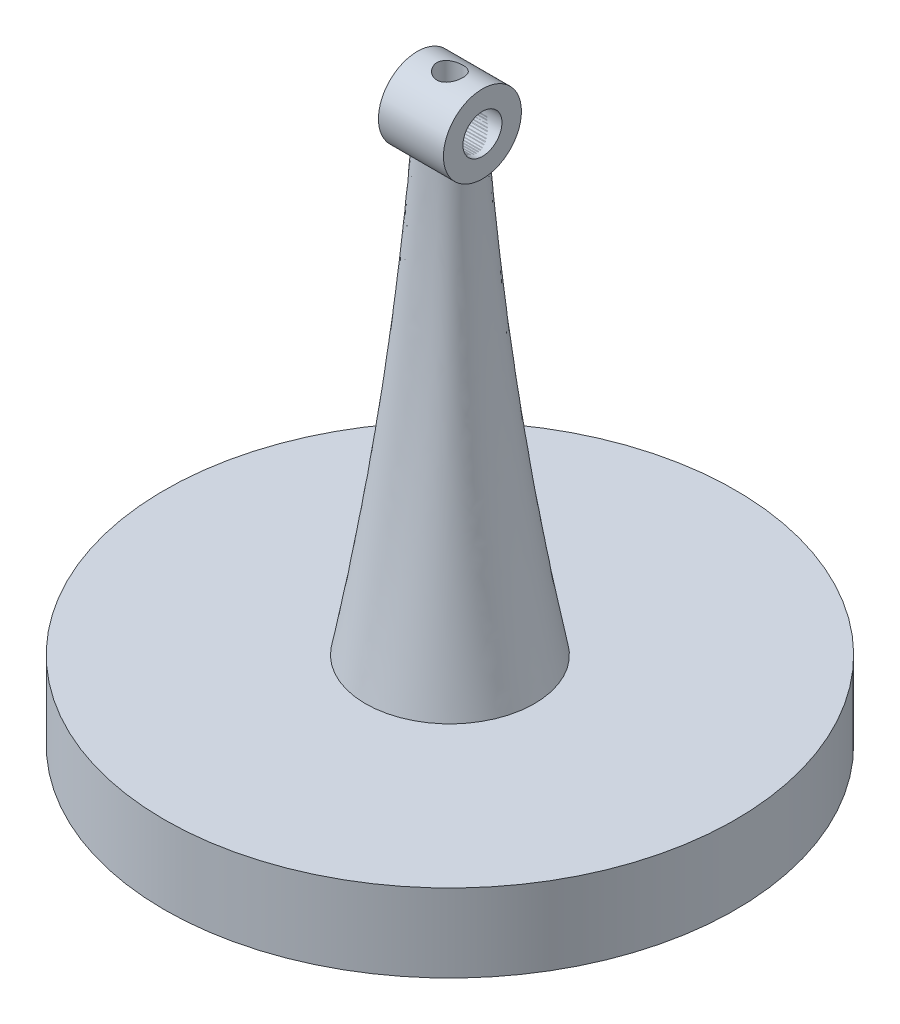
ISO-10303-21;
HEADER;
FILE_DESCRIPTION(('STEP AP214'),'2;1');
FILE_NAME('part.step','',(''),(''),'','','');
FILE_SCHEMA(('AUTOMOTIVE_DESIGN { 1 0 10303 214 1 1 1 1 }'));
ENDSEC;
DATA;
#1=APPLICATION_CONTEXT('core data for automotive mechanical design processes');
#2=APPLICATION_PROTOCOL_DEFINITION('international standard','automotive_design',2000,#1);
#3=PRODUCT_CONTEXT('',#1,'mechanical');
#4=PRODUCT('Part','Part','',(#3));
#5=PRODUCT_RELATED_PRODUCT_CATEGORY('part','',(#4));
#6=PRODUCT_DEFINITION_FORMATION('','',#4);
#7=PRODUCT_DEFINITION_CONTEXT('part definition',#1,'design');
#8=PRODUCT_DEFINITION('design','',#6,#7);
#9=PRODUCT_DEFINITION_SHAPE('','',#8);
#10=(LENGTH_UNIT() NAMED_UNIT(*) SI_UNIT(.MILLI.,.METRE.));
#11=(NAMED_UNIT(*) PLANE_ANGLE_UNIT() SI_UNIT($,.RADIAN.));
#12=(NAMED_UNIT(*) SI_UNIT($,.STERADIAN.) SOLID_ANGLE_UNIT());
#13=UNCERTAINTY_MEASURE_WITH_UNIT(LENGTH_MEASURE(1.E-05),#10,'distance_accuracy_value','');
#14=(GEOMETRIC_REPRESENTATION_CONTEXT(3) GLOBAL_UNCERTAINTY_ASSIGNED_CONTEXT((#13)) GLOBAL_UNIT_ASSIGNED_CONTEXT((#10,
#11,#12)) REPRESENTATION_CONTEXT('',''));
#15=CARTESIAN_POINT('',(0.,0.,0.));
#16=DIRECTION('',(0.,0.,1.));
#17=DIRECTION('',(1.,0.,0.));
#18=AXIS2_PLACEMENT_3D('',#15,#16,#17);
#19=CARTESIAN_POINT('',(-1.25,20.98,0.));
#20=DIRECTION('',(1.,0.,0.));
#21=DIRECTION('',(0.,0.,-1.));
#22=AXIS2_PLACEMENT_3D('',#19,#20,#21);
#23=CYLINDRICAL_SURFACE('',#22,1.5);
#24=CARTESIAN_POINT('',(-1.25,20.98,0.));
#25=DIRECTION('',(1.,0.,0.));
#26=DIRECTION('',(0.,0.,-1.));
#27=AXIS2_PLACEMENT_3D('',#24,#25,#26);
#28=CIRCLE('',#27,1.5);
#29=CARTESIAN_POINT('',(-1.25,20.98,-1.5));
#30=VERTEX_POINT('',#29);
#31=EDGE_CURVE('E13',#30,#30,#28,.T.);
#32=ORIENTED_EDGE('',*,*,#31,.T.);
#33=EDGE_LOOP('',(#32));
#34=FACE_BOUND('',#33,.T.);
#35=CARTESIAN_POINT('',(1.25,20.98,0.));
#36=DIRECTION('',(1.,0.,0.));
#37=DIRECTION('',(0.,0.,-1.));
#38=AXIS2_PLACEMENT_3D('',#35,#36,#37);
#39=CIRCLE('',#38,1.5);
#40=CARTESIAN_POINT('',(1.25,20.98,-1.5));
#41=VERTEX_POINT('',#40);
#42=EDGE_CURVE('E166',#41,#41,#39,.T.);
#43=ORIENTED_EDGE('',*,*,#42,.F.);
#44=EDGE_LOOP('',(#43));
#45=FACE_BOUND('',#44,.T.);
#46=CARTESIAN_POINT('',(0.5,22.48,0.));
#47=CARTESIAN_POINT('',(0.50000012686582,22.4800000765047,0.0272816814433617));
#48=CARTESIAN_POINT('',(0.497759866936391,22.4792488475377,0.0545625972692751));
#49=CARTESIAN_POINT('',(0.488885445591391,22.4763260510164,0.108320880436486));
#50=CARTESIAN_POINT('',(0.482250828025542,22.4741543360107,0.134798164059408));
#51=CARTESIAN_POINT('',(0.464840378307973,22.4686265395323,0.186166394750889));
#52=CARTESIAN_POINT('',(0.454071468770353,22.4652724386545,0.211059912943019));
#53=CARTESIAN_POINT('',(0.428729413580838,22.4577222285864,0.258687468402661));
#54=CARTESIAN_POINT('',(0.414155517498742,22.4535259533379,0.281421078479346));
#55=CARTESIAN_POINT('',(0.38108709757058,22.4445704722161,0.324870837511139));
#56=CARTESIAN_POINT('',(0.362484382869586,22.4397977823228,0.345501850149179));
#57=CARTESIAN_POINT('',(0.322116422646884,22.4303015739117,0.383416346351018));
#58=CARTESIAN_POINT('',(0.300350482536368,22.4255780664382,0.400699092744639));
#59=CARTESIAN_POINT('',(0.253507442401128,22.4165666624014,0.431912471114024));
#60=CARTESIAN_POINT('',(0.22835313013151,22.4122951964352,0.445732429110873));
#61=CARTESIAN_POINT('',(0.175911952773154,22.4048765270363,0.468909436938504));
#62=CARTESIAN_POINT('',(0.148625741427696,22.4017289805919,0.478267848692048));
#63=CARTESIAN_POINT('',(0.0936633892497512,22.3970565165522,0.491936730754162));
#64=CARTESIAN_POINT('',(0.0660313957373302,22.3954804796009,0.496406724138347));
#65=CARTESIAN_POINT('',(0.0103681229003003,22.3939782838957,0.500670561669923));
#66=CARTESIAN_POINT('',(-0.0176630303637377,22.39405161531,0.500465850802425));
#67=CARTESIAN_POINT('',(-0.071968315220251,22.3957950748538,0.495509951851011));
#68=CARTESIAN_POINT('',(-0.0982642014590378,22.3973920792875,0.49096695658331));
#69=CARTESIAN_POINT('',(-0.149696709803889,22.4018832886729,0.477803081424896));
#70=CARTESIAN_POINT('',(-0.174833192717663,22.4047776489341,0.469181713295986));
#71=CARTESIAN_POINT('',(-0.22370637479561,22.4115895556425,0.447969529030054));
#72=CARTESIAN_POINT('',(-0.247414012734729,22.4155228289619,0.435317024353617));
#73=CARTESIAN_POINT('',(-0.292435454139899,22.4239627928823,0.406444553151583));
#74=CARTESIAN_POINT('',(-0.313748563466701,22.4284696489533,0.390223556182006));
#75=CARTESIAN_POINT('',(-0.354545799080377,22.4378366458376,0.353674666341114));
#76=CARTESIAN_POINT('',(-0.373876347254532,22.4427029467739,0.333176575038154));
#77=CARTESIAN_POINT('',(-0.408865633331702,22.4520346919355,0.289169784985033));
#78=CARTESIAN_POINT('',(-0.424524019082249,22.4565000976904,0.265660797830407));
#79=CARTESIAN_POINT('',(-0.451848150117534,22.4645855396889,0.215973806523133));
#80=CARTESIAN_POINT('',(-0.463472745670366,22.4681967500402,0.189771638208168));
#81=CARTESIAN_POINT('',(-0.482101586977856,22.4741028357222,0.135634541682253));
#82=CARTESIAN_POINT('',(-0.489107437711719,22.4763981682744,0.107700219077476));
#83=CARTESIAN_POINT('',(-0.498027833011179,22.4793381353572,0.0521919147646513));
#84=CARTESIAN_POINT('',(-0.500149904586375,22.4800500091687,0.0246547999324221));
#85=CARTESIAN_POINT('',(-0.499833663200767,22.4799445134741,-0.0303875349801187));
#86=CARTESIAN_POINT('',(-0.497396120010066,22.4791274020968,-0.0578927596598238));
#87=CARTESIAN_POINT('',(-0.488194046132017,22.4761001235856,-0.11125993315213));
#88=CARTESIAN_POINT('',(-0.481556896975238,22.4739309935561,-0.137146403417428));
#89=CARTESIAN_POINT('',(-0.46430327776665,22.4684592341502,-0.187427979289781));
#90=CARTESIAN_POINT('',(-0.453686300266162,22.4651564602327,-0.21182289425428));
#91=CARTESIAN_POINT('',(-0.42846478407955,22.4576446564371,-0.259144148196661));
#92=CARTESIAN_POINT('',(-0.4137627033582,22.4534140737815,-0.282014979608665));
#93=CARTESIAN_POINT('',(-0.380902924993473,22.4445262695787,-0.325032415067702));
#94=CARTESIAN_POINT('',(-0.362744171984919,22.4398689179594,-0.345178183897447));
#95=CARTESIAN_POINT('',(-0.322510624495867,22.4303842399124,-0.383126253903507));
#96=CARTESIAN_POINT('',(-0.300295386533375,22.4255588054758,-0.400780484624246));
#97=CARTESIAN_POINT('',(-0.253114216097749,22.4164998664349,-0.432128761160427));
#98=CARTESIAN_POINT('',(-0.228148260694898,22.4122663667656,-0.445822773960422));
#99=CARTESIAN_POINT('',(-0.176163492346702,22.4049119591015,-0.46879846521168));
#100=CARTESIAN_POINT('',(-0.14914896037861,22.4017888045032,-0.478089066098883));
#101=CARTESIAN_POINT('',(-0.0938106749379246,22.3970541619957,-0.491947333396081));
#102=CARTESIAN_POINT('',(-0.065487517283468,22.3954419931135,-0.496517127480622));
#103=CARTESIAN_POINT('',(-0.00990145199339416,22.3939892943754,-0.50063814123519));
#104=CARTESIAN_POINT('',(0.0173411701258687,22.3940620017215,-0.500435128655463));
#105=CARTESIAN_POINT('',(0.0713825374498718,22.3957563496178,-0.495621146727439));
#106=CARTESIAN_POINT('',(0.0981813089764556,22.3973778979794,-0.491010439729443));
#107=CARTESIAN_POINT('',(0.150067831506334,22.4019226213947,-0.47768590656349));
#108=CARTESIAN_POINT('',(0.175178412503616,22.4048204900776,-0.46905167300744));
#109=CARTESIAN_POINT('',(0.223613703467766,22.4115819941272,-0.447989682880191));
#110=CARTESIAN_POINT('',(0.24693801559363,22.4154458438265,-0.435561084276989));
#111=CARTESIAN_POINT('',(0.292241834961846,22.4239141461203,-0.406630346291624));
#112=CARTESIAN_POINT('',(0.314118250949298,22.428543558208,-0.389974121382266));
#113=CARTESIAN_POINT('',(0.354844906691996,22.4379167814189,-0.353321441567848));
#114=CARTESIAN_POINT('',(0.373694287844009,22.4426606245626,-0.333324042225747));
#115=CARTESIAN_POINT('',(0.408572206144619,22.451950152627,-0.289620778460337));
#116=CARTESIAN_POINT('',(0.424462173875508,22.4564809090061,-0.265800756749862));
#117=CARTESIAN_POINT('',(0.451995214425316,22.4646299558633,-0.215678678703314));
#118=CARTESIAN_POINT('',(0.463639372961019,22.4682484795397,-0.189377259066175));
#119=CARTESIAN_POINT('',(0.481860816244338,22.4740275753427,-0.136246823600487));
#120=CARTESIAN_POINT('',(0.488641233131689,22.4762460621126,-0.109493878838204));
#121=CARTESIAN_POINT('',(0.497710140338563,22.4792320353211,-0.0551602080051238));
#122=CARTESIAN_POINT('',(0.499999871748268,22.4799999226595,-0.0275797127843734));
#123=CARTESIAN_POINT('',(0.5,22.48,0.));
#124=B_SPLINE_CURVE_WITH_KNOTS('',3,(#46,#47,#48,#49,#50,#51,#52,#53,#54,#55,#56,#57,#58,#59,
#60,#61,#62,#63,#64,#65,#66,#67,#68,#69,#70,#71,#72,#73,#74,#75,#76,#77,#78,#79,#80,#81,#82,#83,
#84,#85,#86,#87,#88,#89,#90,#91,#92,#93,#94,#95,#96,#97,#98,#99,#100,#101,#102,#103,#104,#105,
#106,#107,#108,#109,#110,#111,#112,#113,#114,#115,#116,#117,#118,#119,#120,#121,#122,#123),
.UNSPECIFIED.,.T.,.F.,(4,2,2,2,2,2,2,2,2,2,2,2,2,2,2,2,2,2,2,2,2,2,2,2,2,2,2,2,2,2,2,2,2,2,2,2,
2,2,4),(0.,0.0817435530130054,0.16349559263376,0.245111336435137,0.32674318889955,
0.41092342141378,0.495122166437651,0.581741924117352,0.668335223464167,0.752009628687921,
0.835658169894179,0.915484132713153,0.995319654234162,1.07644085573241,1.15758551274779,
1.24296652901359,1.32835572978984,1.41459202820854,1.50079834434279,1.5832679158326,
1.66572356577763,1.74579078984782,1.82586822637727,1.90805199917543,1.99026090406621,
2.07620511436051,2.16215004113174,2.24792006907883,2.33365142346098,2.41497833023984,
2.49630039666268,2.57607793530789,2.65587319078569,2.73915033336483,2.8224510555247,
2.9089983040813,2.99552340566808,3.07818279177487,3.1608193300965),.UNSPECIFIED.);
#125=CARTESIAN_POINT('',(0.5,22.48,0.));
#126=VERTEX_POINT('',#125);
#127=EDGE_CURVE('E174',#126,#126,#124,.T.);
#128=ORIENTED_EDGE('',*,*,#127,.T.);
#129=EDGE_LOOP('',(#128));
#130=FACE_BOUND('',#129,.T.);
#131=ADVANCED_FACE('F149',(#34,#45,#130),#23,.T.);
#132=CARTESIAN_POINT('',(-1.25,20.98,0.));
#133=DIRECTION('',(1.,0.,0.));
#134=DIRECTION('',(0.,0.,-1.));
#135=AXIS2_PLACEMENT_3D('',#132,#133,#134);
#136=CYLINDRICAL_SURFACE('',#135,0.750000000000001);
#137=CARTESIAN_POINT('',(-1.25,20.98,0.));
#138=DIRECTION('',(1.,0.,0.));
#139=DIRECTION('',(0.,0.,-1.));
#140=AXIS2_PLACEMENT_3D('',#137,#138,#139);
#141=CIRCLE('',#140,0.750000000000001);
#142=CARTESIAN_POINT('',(-1.25,20.98,-0.750000000000001));
#143=VERTEX_POINT('',#142);
#144=EDGE_CURVE('E162',#143,#143,#141,.T.);
#145=ORIENTED_EDGE('',*,*,#144,.F.);
#146=EDGE_LOOP('',(#145));
#147=FACE_BOUND('',#146,.T.);
#148=CARTESIAN_POINT('',(1.25,20.98,0.));
#149=DIRECTION('',(1.,0.,0.));
#150=DIRECTION('',(0.,0.,-1.));
#151=AXIS2_PLACEMENT_3D('',#148,#149,#150);
#152=CIRCLE('',#151,0.750000000000001);
#153=CARTESIAN_POINT('',(1.25,20.98,-0.750000000000001));
#154=VERTEX_POINT('',#153);
#155=EDGE_CURVE('E171',#154,#154,#152,.T.);
#156=ORIENTED_EDGE('',*,*,#155,.T.);
#157=EDGE_LOOP('',(#156));
#158=FACE_BOUND('',#157,.T.);
#159=CARTESIAN_POINT('',(0.,21.5390169943749,-0.5));
#160=CARTESIAN_POINT('',(0.0244070776840954,21.5390193832135,-0.49999863498352));
#161=CARTESIAN_POINT('',(0.048822688418298,21.5406451774997,-0.498197481256266));
#162=CARTESIAN_POINT('',(0.0967799779214887,21.5468299313731,-0.491145670797246));
#163=CARTESIAN_POINT('',(0.120320008884651,21.5513941520635,-0.485888826470456));
#164=CARTESIAN_POINT('',(0.165683860466932,21.5626414645324,-0.472339654190862));
#165=CARTESIAN_POINT('',(0.187521924183623,21.569303904478,-0.464076795035392));
#166=CARTESIAN_POINT('',(0.229466458087109,21.583960236713,-0.444835020984149));
#167=CARTESIAN_POINT('',(0.249572567494098,21.5919544053994,-0.433855542030581));
#168=CARTESIAN_POINT('',(0.290911721903807,21.6098651823272,-0.407506025019366));
#169=CARTESIAN_POINT('',(0.311833029429035,21.6198873402251,-0.391718588629478));
#170=CARTESIAN_POINT('',(0.351000677218425,21.6398620682709,-0.357048049351916));
#171=CARTESIAN_POINT('',(0.36924438041445,21.6498145607451,-0.33816193294292));
#172=CARTESIAN_POINT('',(0.40516091469522,21.670222046309,-0.294539226235978));
#173=CARTESIAN_POINT('',(0.422370627943749,21.6805419646171,-0.269351609914803));
#174=CARTESIAN_POINT('',(0.45216052387239,21.6988962112069,-0.215617741053339));
#175=CARTESIAN_POINT('',(0.464745878507682,21.7069330905775,-0.187075288080716));
#176=CARTESIAN_POINT('',(0.483389100254282,21.7189997686617,-0.130812268370296));
#177=CARTESIAN_POINT('',(0.490020836123828,21.7233779390396,-0.103358681295646));
#178=CARTESIAN_POINT('',(0.498546122320886,21.7290243636548,-0.0474238621827458));
#179=CARTESIAN_POINT('',(0.500445639806351,21.7302965344059,-0.0189439703217284));
#180=CARTESIAN_POINT('',(0.499456887512755,21.7296384043074,0.0335367625578244));
#181=CARTESIAN_POINT('',(0.497252737170764,21.7281656622753,0.0575601595019357));
#182=CARTESIAN_POINT('',(0.489477237160325,21.7230204569751,0.104809658317514));
#183=CARTESIAN_POINT('',(0.483905641924176,21.7193478332828,0.128035701912199));
#184=CARTESIAN_POINT('',(0.469701078801438,21.7101302292594,0.17301948441757));
#185=CARTESIAN_POINT('',(0.461080278700454,21.7045926949568,0.194782655961269));
#186=CARTESIAN_POINT('',(0.44111158926191,21.6920527611908,0.236552287663175));
#187=CARTESIAN_POINT('',(0.429763202124747,21.685050094363,0.256558426242141));
#188=CARTESIAN_POINT('',(0.403005315635176,21.6690451461268,0.297071072990657));
#189=CARTESIAN_POINT('',(0.387258119161966,21.6599010219802,0.31729787024907));
#190=CARTESIAN_POINT('',(0.35302533013011,21.6410015045676,0.354997018745571));
#191=CARTESIAN_POINT('',(0.334535513516751,21.6312451820382,0.372465033798458));
#192=CARTESIAN_POINT('',(0.292009197446911,21.6103751123605,0.406930588315245));
#193=CARTESIAN_POINT('',(0.267557230071629,21.5992858000224,0.423433982815731));
#194=CARTESIAN_POINT('',(0.215622540195098,21.5786890270778,0.452087187363571));
#195=CARTESIAN_POINT('',(0.188145001396809,21.5691789288373,0.464244296637116));
#196=CARTESIAN_POINT('',(0.138820234482036,21.5556571757673,0.480831811419357));
#197=CARTESIAN_POINT('',(0.117601657486106,21.5508509114443,0.486476979368779));
#198=CARTESIAN_POINT('',(0.0742401275460673,21.543522599474,0.49494888894997));
#199=CARTESIAN_POINT('',(0.0520988472070614,21.5409965919556,0.497780517410882));
#200=CARTESIAN_POINT('',(0.00738925338998441,21.5386188924687,0.500448500372263));
#201=CARTESIAN_POINT('',(-0.0151804946294691,21.5387788346673,0.500271824383034));
#202=CARTESIAN_POINT('',(-0.0599209584887981,21.5417747009213,0.496904074290662));
#203=CARTESIAN_POINT('',(-0.0820913360276867,21.544612794118,0.493710556724944));
#204=CARTESIAN_POINT('',(-0.1243473543862,21.5523199437557,0.484749527968672));
#205=CARTESIAN_POINT('',(-0.14448192724666,21.5570829676885,0.479115436328642));
#206=CARTESIAN_POINT('',(-0.183531559016105,21.5680748963198,0.46555760406773));
#207=CARTESIAN_POINT('',(-0.202446205754526,21.5743042931836,0.457633094499908));
#208=CARTESIAN_POINT('',(-0.242550500943963,21.5890287090536,0.437908366515755));
#209=CARTESIAN_POINT('',(-0.263439202815248,21.597727703844,0.425650072113155));
#210=CARTESIAN_POINT('',(-0.303104200582259,21.6156562872823,0.398381828822968));
#211=CARTESIAN_POINT('',(-0.321877879164484,21.6248865124464,0.383368529729879));
#212=CARTESIAN_POINT('',(-0.360990586892403,21.6451891957079,0.347191644256549));
#213=CARTESIAN_POINT('',(-0.380775712068715,21.6562236303212,0.325400966279174));
#214=CARTESIAN_POINT('',(-0.416454170728047,21.6769389546291,0.278274872172408));
#215=CARTESIAN_POINT('',(-0.432350942812357,21.6866210369796,0.252942619366139));
#216=CARTESIAN_POINT('',(-0.456972934730588,21.7019770531006,0.204371868704485));
#217=CARTESIAN_POINT('',(-0.466489126110322,21.7080636452761,0.181665591221554));
#218=CARTESIAN_POINT('',(-0.482151798579666,21.7181967696688,0.134689269755798));
#219=CARTESIAN_POINT('',(-0.488301125714782,21.7222450246802,0.110420565965121));
#220=CARTESIAN_POINT('',(-0.496924240959738,21.7279459100665,0.0608423480760647));
#221=CARTESIAN_POINT('',(-0.499381669876642,21.7295878771414,0.0355287092313005));
#222=CARTESIAN_POINT('',(-0.500411962854291,21.7302745525726,-0.0152138866448036));
#223=CARTESIAN_POINT('',(-0.498985187989176,21.7293195023466,-0.0406428327378411));
#224=CARTESIAN_POINT('',(-0.492585127748773,21.7250738899439,-0.0889393831319761));
#225=CARTESIAN_POINT('',(-0.487877253784226,21.7219581930269,-0.11185878576814));
#226=CARTESIAN_POINT('',(-0.475440497642743,21.7138402655152,-0.156504605748237));
#227=CARTESIAN_POINT('',(-0.467711146164711,21.7088377418597,-0.178230837168601));
#228=CARTESIAN_POINT('',(-0.449015323777597,21.6969794137241,-0.221286824154885));
#229=CARTESIAN_POINT('',(-0.437887423120557,21.6900331223988,-0.242520897311469));
#230=CARTESIAN_POINT('',(-0.41296233884947,21.6749385205558,-0.282888165658915));
#231=CARTESIAN_POINT('',(-0.399163558033892,21.6667894914901,-0.302020092968711));
#232=CARTESIAN_POINT('',(-0.366842774389124,21.6484823288226,-0.340823555555943));
#233=CARTESIAN_POINT('',(-0.347919243976968,21.6382097852622,-0.360106699021094));
#234=CARTESIAN_POINT('',(-0.307221614512106,21.6176333946743,-0.395400055909323));
#235=CARTESIAN_POINT('',(-0.285445402771145,21.60732953003,-0.411407820861153));
#236=CARTESIAN_POINT('',(-0.241033102331492,21.5884605338798,-0.438783133747656));
#237=CARTESIAN_POINT('',(-0.218589547501261,21.579822716954,-0.450411617234018));
#238=CARTESIAN_POINT('',(-0.171678887763389,21.5643687538787,-0.470289505859439));
#239=CARTESIAN_POINT('',(-0.147215826600274,21.5575490777471,-0.47854547569061));
#240=CARTESIAN_POINT('',(-0.102307132863304,21.5479776302106,-0.489840656181975));
#241=CARTESIAN_POINT('',(-0.0821729406695298,21.5446592398322,-0.49363057096565));
#242=CARTESIAN_POINT('',(-0.0413608997308111,21.5401787993407,-0.498709789581945));
#243=CARTESIAN_POINT('',(-0.0206835138838668,21.5390149699795,-0.500001156768445));
#244=CARTESIAN_POINT('',(0.,21.5390169943749,-0.5));
#245=B_SPLINE_CURVE_WITH_KNOTS('',3,(#159,#160,#161,#162,#163,#164,#165,#166,#167,#168,#169,
#170,#171,#172,#173,#174,#175,#176,#177,#178,#179,#180,#181,#182,#183,#184,#185,#186,#187,#188,
#189,#190,#191,#192,#193,#194,#195,#196,#197,#198,#199,#200,#201,#202,#203,#204,#205,#206,#207,
#208,#209,#210,#211,#212,#213,#214,#215,#216,#217,#218,#219,#220,#221,#222,#223,#224,#225,#226,
#227,#228,#229,#230,#231,#232,#233,#234,#235,#236,#237,#238,#239,#240,#241,#242,#243,#244),
.UNSPECIFIED.,.T.,.F.,(4,2,2,2,2,2,2,2,2,2,2,2,2,2,2,2,2,2,2,2,2,2,2,2,2,2,2,2,2,2,2,2,2,2,2,2,
2,2,2,2,2,2,4),(0.,0.0731267326804708,0.146384760564686,0.218943162803868,0.291516643166106,
0.375386692671302,0.45933879609037,0.555417577515404,0.651388573471132,0.736593705158659,
0.821691341720484,0.893848837389105,0.966011595709127,1.03788957993273,1.10978069225724,
1.19111881486631,1.2725835369913,1.36669675876204,1.46065117435954,1.527815226003,
1.59486241558843,1.66220009409483,1.72959235892625,1.79369112926709,1.85781144411213,
1.93474807512742,2.01177889199932,2.10563671129794,2.19941122642696,2.27517645152478,
2.35087753221673,2.42691307316099,2.50294154611096,2.57344195561992,2.6439533197277,
2.71854465746034,2.79318073982329,2.87955551571611,2.96599462605537,3.0458353145007,
3.12551984163202,3.18754154070582,3.24951199903988),.UNSPECIFIED.);
#246=CARTESIAN_POINT('',(0.,21.5390169943749,-0.5));
#247=VERTEX_POINT('',#246);
#248=EDGE_CURVE('E153',#247,#247,#245,.T.);
#249=ORIENTED_EDGE('',*,*,#248,.F.);
#250=EDGE_LOOP('',(#249));
#251=FACE_BOUND('',#250,.T.);
#252=ADVANCED_FACE('F189',(#147,#158,#251),#136,.F.);
#253=CARTESIAN_POINT('',(-1.25,20.98,0.));
#254=DIRECTION('',(1.,0.,0.));
#255=DIRECTION('',(0.,0.,-1.));
#256=AXIS2_PLACEMENT_3D('',#253,#254,#255);
#257=PLANE('',#256);
#258=ORIENTED_EDGE('',*,*,#144,.T.);
#259=EDGE_LOOP('',(#258));
#260=FACE_BOUND('',#259,.T.);
#261=ORIENTED_EDGE('',*,*,#31,.F.);
#262=EDGE_LOOP('',(#261));
#263=FACE_BOUND('',#262,.T.);
#264=ADVANCED_FACE('F187',(#260,#263),#257,.F.);
#265=CARTESIAN_POINT('',(1.25,20.98,0.));
#266=DIRECTION('',(1.,0.,0.));
#267=DIRECTION('',(0.,0.,-1.));
#268=AXIS2_PLACEMENT_3D('',#265,#266,#267);
#269=PLANE('',#268);
#270=ORIENTED_EDGE('',*,*,#42,.T.);
#271=EDGE_LOOP('',(#270));
#272=FACE_BOUND('',#271,.T.);
#273=ORIENTED_EDGE('',*,*,#155,.F.);
#274=EDGE_LOOP('',(#273));
#275=FACE_BOUND('',#274,.T.);
#276=ADVANCED_FACE('F183',(#272,#275),#269,.T.);
#277=CARTESIAN_POINT('',(0.,22.48,0.));
#278=DIRECTION('',(0.,-1.,0.));
#279=DIRECTION('',(0.,0.,-1.));
#280=AXIS2_PLACEMENT_3D('',#277,#278,#279);
#281=CYLINDRICAL_SURFACE('',#280,0.5);
#282=ORIENTED_EDGE('',*,*,#127,.F.);
#283=EDGE_LOOP('',(#282));
#284=FACE_BOUND('',#283,.T.);
#285=ORIENTED_EDGE('',*,*,#248,.T.);
#286=EDGE_LOOP('',(#285));
#287=FACE_BOUND('',#286,.T.);
#288=ADVANCED_FACE('F179',(#284,#287),#281,.F.);
#289=CLOSED_SHELL('',(#131,#252,#264,#276,#288));
#290=MANIFOLD_SOLID_BREP('B2',#289);
#291=CARTESIAN_POINT('',(0.,20.98,0.));
#292=DIRECTION('',(0.,1.,0.));
#293=DIRECTION('',(0.,0.,1.));
#294=AXIS2_PLACEMENT_3D('',#291,#292,#293);
#295=PLANE('',#294);
#296=DIRECTION('',(-1.,0.,0.));
#297=VECTOR('',#296,1.);
#298=CARTESIAN_POINT('',(8.75,20.98,-0.750000000000001));
#299=LINE('',#298,#297);
#300=CARTESIAN_POINT('',(0.661458709773382,20.98,-0.750000000000001));
#301=VERTEX_POINT('',#300);
#302=CARTESIAN_POINT('',(-0.661443148435913,20.98,-0.750000000515777));
#303=VERTEX_POINT('',#302);
#304=EDGE_CURVE('E268',#301,#303,#299,.T.);
#305=ORIENTED_EDGE('',*,*,#304,.F.);
#306=CARTESIAN_POINT('',(0.,20.98,0.));
#307=DIRECTION('',(0.,1.,0.));
#308=DIRECTION('',(0.,0.,1.));
#309=AXIS2_PLACEMENT_3D('',#306,#307,#308);
#310=CIRCLE('',#309,1.);
#311=EDGE_CURVE('E282',#301,#303,#310,.T.);
#312=ORIENTED_EDGE('',*,*,#311,.T.);
#313=EDGE_LOOP('',(#305,#312));
#314=FACE_BOUND('',#313,.T.);
#315=ADVANCED_FACE('F247',(#314),#295,.T.);
#316=CARTESIAN_POINT('',(0.,3.,0.));
#317=DIRECTION('',(0.,1.,0.));
#318=DIRECTION('',(0.,0.,1.));
#319=AXIS2_PLACEMENT_3D('',#316,#317,#318);
#320=PLANE('',#319);
#321=CARTESIAN_POINT('',(0.,3.,0.));
#322=DIRECTION('',(0.,1.,0.));
#323=DIRECTION('',(0.,0.,1.));
#324=AXIS2_PLACEMENT_3D('',#321,#322,#323);
#325=CIRCLE('',#324,10.98);
#326=CARTESIAN_POINT('',(0.,3.,10.98));
#327=VERTEX_POINT('',#326);
#328=EDGE_CURVE('E278',#327,#327,#325,.T.);
#329=ORIENTED_EDGE('',*,*,#328,.T.);
#330=EDGE_LOOP('',(#329));
#331=FACE_BOUND('',#330,.T.);
#332=CARTESIAN_POINT('',(0.,3.,-3.25));
#333=CARTESIAN_POINT('',(0.154645710822041,3.,-3.24999950442796));
#334=CARTESIAN_POINT('',(0.309307341840926,3.,-3.23883299751269));
#335=CARTESIAN_POINT('',(0.615620380263568,3.,-3.19473189435949));
#336=CARTESIAN_POINT('',(0.767269776812545,3.,-3.16178322902447));
#337=CARTESIAN_POINT('',(1.00361890716298,3.,-3.09253510126419));
#338=CARTESIAN_POINT('',(1.09038384598765,3.,-3.06309077348064));
#339=CARTESIAN_POINT('',(1.2611059686382,3.,-2.99689246280548));
#340=CARTESIAN_POINT('',(1.3450628841634,3.,-2.96013778374281));
#341=CARTESIAN_POINT('',(1.50957803117799,3.,-2.87963028824717));
#342=CARTESIAN_POINT('',(1.59013535958231,3.,-2.83587562690605));
#343=CARTESIAN_POINT('',(1.7472782625511,3.,-2.74177585907114));
#344=CARTESIAN_POINT('',(1.82386371650126,3.,-2.691430552602));
#345=CARTESIAN_POINT('',(2.0463112090218,3.,-2.53141114216515));
#346=CARTESIAN_POINT('',(2.18561439190265,3.,-2.41238479608292));
#347=CARTESIAN_POINT('',(2.44201142765815,3.,-2.15244729433924));
#348=CARTESIAN_POINT('',(2.55910703413378,3.,-2.01153786825475));
#349=CARTESIAN_POINT('',(2.71590889369063,3.,-1.78719259338293));
#350=CARTESIAN_POINT('',(2.76506248098321,3.,-1.71019145579585));
#351=CARTESIAN_POINT('',(2.85676220624264,3.,-1.55232888485748));
#352=CARTESIAN_POINT('',(2.89930885858635,3.,-1.47146775266401));
#353=CARTESIAN_POINT('',(2.97739415597304,3.,-1.30643081513155));
#354=CARTESIAN_POINT('',(3.01293257331345,3.,-1.22225490219952));
#355=CARTESIAN_POINT('',(3.07672869275163,3.,-1.0511834876223));
#356=CARTESIAN_POINT('',(3.1049860409722,3.,-0.964287854022337));
#357=CARTESIAN_POINT('',(3.15410464062491,3.,-0.788493061958903));
#358=CARTESIAN_POINT('',(3.17497057752272,3.,-0.699595210869366));
#359=CARTESIAN_POINT('',(3.20920373651042,3.,-0.520368173301776));
#360=CARTESIAN_POINT('',(3.22257103793882,3.,-0.43003900197805));
#361=CARTESIAN_POINT('',(3.24169265109474,3.,-0.248569201491595));
#362=CARTESIAN_POINT('',(3.24744643398697,3.,-0.157428516403696));
#363=CARTESIAN_POINT('',(3.25119037490692,3.,0.0250091102213498));
#364=CARTESIAN_POINT('',(3.249180744038,3.,0.116306047442199));
#365=CARTESIAN_POINT('',(3.23745797622074,3.,0.298576407824787));
#366=CARTESIAN_POINT('',(3.22773068041198,3.,0.38954892737859));
#367=CARTESIAN_POINT('',(3.20070376252114,3.,0.570342145711041));
#368=CARTESIAN_POINT('',(3.18340365881378,3.,0.660162770855972));
#369=CARTESIAN_POINT('',(3.12029914245735,3.,0.926941452480422));
#370=CARTESIAN_POINT('',(3.0632791225054,3.,1.10138994956638));
#371=CARTESIAN_POINT('',(2.92035865148027,3.,1.43816398007018));
#372=CARTESIAN_POINT('',(2.834438566864,3.,1.60048118010318));
#373=CARTESIAN_POINT('',(2.6863129813405,3.,1.83138239938665));
#374=CARTESIAN_POINT('',(2.63370038519162,3.,1.90628657619653));
#375=CARTESIAN_POINT('',(2.52236876432076,3.,2.05143542097543));
#376=CARTESIAN_POINT('',(2.46365022877968,3.,2.12168046147651));
#377=CARTESIAN_POINT('',(2.34043987196172,3.,2.25695631501081));
#378=CARTESIAN_POINT('',(2.27594573665197,3.,2.32198501812317));
#379=CARTESIAN_POINT('',(2.14165746410779,3.,2.44632511490146));
#380=CARTESIAN_POINT('',(2.07186304358615,3.,2.50563620258989));
#381=CARTESIAN_POINT('',(1.92754966763954,3.,2.61818689487709));
#382=CARTESIAN_POINT('',(1.85303102127527,3.,2.67142689601227));
#383=CARTESIAN_POINT('',(1.69979580910775,3.,2.77147486712635));
#384=CARTESIAN_POINT('',(1.62107931516439,3.,2.8182829471596));
#385=CARTESIAN_POINT('',(1.46006735020795,3.,2.90506717867576));
#386=CARTESIAN_POINT('',(1.37777564502016,3.,2.94505031012806));
#387=CARTESIAN_POINT('',(1.2100836186852,3.,3.01784846144958));
#388=CARTESIAN_POINT('',(1.12468337701368,3.,3.05066366443058));
#389=CARTESIAN_POINT('',(0.951413603158001,3.,3.10895521892763));
#390=CARTESIAN_POINT('',(0.863544149389467,3.,3.1344318032103));
#391=CARTESIAN_POINT('',(0.686000792020061,3.,3.17793883367046));
#392=CARTESIAN_POINT('',(0.596326780849224,3.,3.19596883456877));
#393=CARTESIAN_POINT('',(0.32582324656553,3.,3.23863101076164));
#394=CARTESIAN_POINT('',(0.14307564397079,3.,3.25198147956074));
#395=CARTESIAN_POINT('',(-0.222036613835569,3.,3.24753360858116));
#396=CARTESIAN_POINT('',(-0.404401270532567,3.,3.2297353898471));
#397=CARTESIAN_POINT('',(-0.673729053934826,3.,3.1805567537709));
#398=CARTESIAN_POINT('',(-0.762879039585631,3.,3.16038907399177));
#399=CARTESIAN_POINT('',(-0.93919439879772,3.,3.11265095809272));
#400=CARTESIAN_POINT('',(-1.02635993362208,3.,3.08508112584245));
#401=CARTESIAN_POINT('',(-1.19803284825147,3.,3.02264059132367));
#402=CARTESIAN_POINT('',(-1.28254018013017,3.,2.98776975750769));
#403=CARTESIAN_POINT('',(-1.4482917194345,3.,2.9109742390776));
#404=CARTESIAN_POINT('',(-1.52953574491208,3.,2.86904916182334));
#405=CARTESIAN_POINT('',(-1.68812877318365,3.,2.77859388482058));
#406=CARTESIAN_POINT('',(-1.76548228432532,3.,2.73007158338422));
#407=CARTESIAN_POINT('',(-1.91586399520278,3.,2.6267354428855));
#408=CARTESIAN_POINT('',(-1.98889228172637,3.,2.57192173012834));
#409=CARTESIAN_POINT('',(-2.13010219999117,3.,2.45635785547461));
#410=CARTESIAN_POINT('',(-2.19828351871146,3.,2.3956073107734));
#411=CARTESIAN_POINT('',(-2.3292290912609,3.,2.26852783096285));
#412=CARTESIAN_POINT('',(-2.39199344058215,3.,2.20219899423018));
#413=CARTESIAN_POINT('',(-2.51179070624783,3.,2.06439107927463));
#414=CARTESIAN_POINT('',(-2.56881576999705,3.,1.99290516845913));
#415=CARTESIAN_POINT('',(-2.67667772917769,3.,1.84543317310017));
#416=CARTESIAN_POINT('',(-2.72751434042231,3.,1.76944688212775));
#417=CARTESIAN_POINT('',(-2.87017596917891,3.,1.53551738296105));
#418=CARTESIAN_POINT('',(-2.95226523812103,3.,1.37147386061163));
#419=CARTESIAN_POINT('',(-3.0874342343755,3.,1.03167562982743));
#420=CARTESIAN_POINT('',(-3.14048815392171,3.,0.85591065804523));
#421=CARTESIAN_POINT('',(-3.19755868288014,3.,0.587713824899169));
#422=CARTESIAN_POINT('',(-3.21283143601712,3.,0.497534301572568));
#423=CARTESIAN_POINT('',(-3.23578134565007,3.,0.316106219976651));
#424=CARTESIAN_POINT('',(-3.2434517907225,3.,0.224856788944319));
#425=CARTESIAN_POINT('',(-3.25101612632862,3.,0.0420176014616255));
#426=CARTESIAN_POINT('',(-3.25090805102159,3.,-0.0495722351701799));
#427=CARTESIAN_POINT('',(-3.24291463917992,3.,-0.232447769964199));
#428=CARTESIAN_POINT('',(-3.23502622808973,3.,-0.323733333577753));
#429=CARTESIAN_POINT('',(-3.21161952911244,3.,-0.505312899397563));
#430=CARTESIAN_POINT('',(-3.19610172422659,3.,-0.595606964003687));
#431=CARTESIAN_POINT('',(-3.15755424286871,3.,-0.774566678291065));
#432=CARTESIAN_POINT('',(-3.13452543566864,3.,-0.863232515158516));
#433=CARTESIAN_POINT('',(-3.08110325367891,3.,-1.03824072312472));
#434=CARTESIAN_POINT('',(-3.05071593189862,3.,-1.12458493942848));
#435=CARTESIAN_POINT('',(-2.98267691878968,3.,-1.2943640339972));
#436=CARTESIAN_POINT('',(-2.94502513466958,3.,-1.37779887508363));
#437=CARTESIAN_POINT('',(-2.86281060006781,3.,-1.54118301960308));
#438=CARTESIAN_POINT('',(-2.81824819273267,3.,-1.62113249584927));
#439=CARTESIAN_POINT('',(-2.7225836133972,3.,-1.77701664258425));
#440=CARTESIAN_POINT('',(-2.67148130756412,3.,-1.85295123086726));
#441=CARTESIAN_POINT('',(-2.56319966462252,3.,-2.00012744761114));
#442=CARTESIAN_POINT('',(-2.50603305669357,3.,-2.07137841690073));
#443=CARTESIAN_POINT('',(-2.38591696175215,3.,-2.2087878559927));
#444=CARTESIAN_POINT('',(-2.32296733062872,3.,-2.27494619881303));
#445=CARTESIAN_POINT('',(-2.12597525092526,3.,-2.46504356457251));
#446=CARTESIAN_POINT('',(-1.98370291132768,3.,-2.58072289084199));
#447=CARTESIAN_POINT('',(-1.75759438256311,3.,-2.73516577455185));
#448=CARTESIAN_POINT('',(-1.68004901261668,3.,-2.78349472795664));
#449=CARTESIAN_POINT('',(-1.52115433182355,3.,-2.873504781944));
#450=CARTESIAN_POINT('',(-1.43980517722773,3.,-2.91518615528444));
#451=CARTESIAN_POINT('',(-1.27390450166565,3.,-2.99146188679299));
#452=CARTESIAN_POINT('',(-1.18935465523939,3.,-3.02605989174738));
#453=CARTESIAN_POINT('',(-1.01764947003075,3.,-3.08795703104866));
#454=CARTESIAN_POINT('',(-0.930494432872732,3.,-3.11525700673728));
#455=CARTESIAN_POINT('',(-0.705156182357761,3.,-3.17559525291612));
#456=CARTESIAN_POINT('',(-0.565533185387393,3.,-3.20339044680919));
#457=CARTESIAN_POINT('',(-0.283943928197894,3.,-3.24058919999127));
#458=CARTESIAN_POINT('',(-0.141978673579653,3.,-3.25000045497972));
#459=CARTESIAN_POINT('',(0.,3.,-3.25));
#460=B_SPLINE_CURVE_WITH_KNOTS('',3,(#332,#333,#334,#335,#336,#337,#338,#339,#340,#341,#342,
#343,#344,#345,#346,#347,#348,#349,#350,#351,#352,#353,#354,#355,#356,#357,#358,#359,#360,#361,
#362,#363,#364,#365,#366,#367,#368,#369,#370,#371,#372,#373,#374,#375,#376,#377,#378,#379,#380,
#381,#382,#383,#384,#385,#386,#387,#388,#389,#390,#391,#392,#393,#394,#395,#396,#397,#398,#399,
#400,#401,#402,#403,#404,#405,#406,#407,#408,#409,#410,#411,#412,#413,#414,#415,#416,#417,#418,
#419,#420,#421,#422,#423,#424,#425,#426,#427,#428,#429,#430,#431,#432,#433,#434,#435,#436,#437,
#438,#439,#440,#441,#442,#443,#444,#445,#446,#447,#448,#449,#450,#451,#452,#453,#454,#455,#456,
#457,#458,#459),.UNSPECIFIED.,.T.,.F.,(4,2,2,2,2,2,2,2,2,2,2,2,2,2,2,2,2,2,2,2,2,2,2,2,2,2,2,2,
2,2,2,2,2,2,2,2,2,2,2,2,2,2,2,2,2,2,2,2,2,2,2,2,2,2,2,2,2,2,2,2,2,2,2,4),(0.,0.463605413177827,
0.927510562056513,1.20209266380193,1.47670092676819,1.75138168480241,2.02607077921586,
2.57297287744604,3.11983177205414,3.39362773245617,3.66740236602617,3.94118589326547,
4.2149827245233,4.48860568220974,4.76222574480342,5.03586481205976,5.30949643855302,
5.58363123482281,5.85778346840707,6.40557239641671,6.95373422439536,7.228078129853,
7.50240007299715,7.7768324210523,8.05127944717832,8.32570853736314,8.60013293130326,
8.87427496384184,9.14840999233351,9.42253632484112,9.6966790467552,10.2436005034904,
10.7905198348791,11.0644662928175,11.3383904089149,11.6123194609276,11.8862637649156,
12.1598829394837,12.4334966218855,12.7071279584475,12.9807544703619,13.2547504138957,
13.528758935159,14.0762674155728,14.6242617560517,14.8983914903759,15.1727630152633,
15.4472038814372,15.7217532418865,15.9962852234169,16.270785443764,16.5450606266118,
16.8193393131015,17.0936043846588,17.3678750696854,17.6415810346476,17.9152938221204,
18.4622855892997,18.7361681266932,19.0100394234776,19.2837693644004,19.5574677351789,
19.9832774941971,20.4089089667898),.UNSPECIFIED.);
#461=CARTESIAN_POINT('',(0.,3.,-3.25));
#462=VERTEX_POINT('',#461);
#463=EDGE_CURVE('E284',#462,#462,#460,.F.);
#464=ORIENTED_EDGE('',*,*,#463,.F.);
#465=EDGE_LOOP('',(#464));
#466=FACE_BOUND('',#465,.T.);
#467=ADVANCED_FACE('F351',(#331,#466),#320,.T.);
#468=CARTESIAN_POINT('',(0.,3.,0.));
#469=DIRECTION('',(0.,-1.,0.));
#470=DIRECTION('',(0.,0.,-1.));
#471=AXIS2_PLACEMENT_3D('',#468,#469,#470);
#472=CYLINDRICAL_SURFACE('',#471,10.98);
#473=ORIENTED_EDGE('',*,*,#328,.F.);
#474=EDGE_LOOP('',(#473));
#475=FACE_BOUND('',#474,.T.);
#476=CARTESIAN_POINT('',(0.,0.,0.));
#477=DIRECTION('',(0.,1.,0.));
#478=DIRECTION('',(0.,0.,1.));
#479=AXIS2_PLACEMENT_3D('',#476,#477,#478);
#480=CIRCLE('',#479,10.98);
#481=CARTESIAN_POINT('',(0.,0.,10.98));
#482=VERTEX_POINT('',#481);
#483=EDGE_CURVE('E289',#482,#482,#480,.T.);
#484=ORIENTED_EDGE('',*,*,#483,.T.);
#485=EDGE_LOOP('',(#484));
#486=FACE_BOUND('',#485,.T.);
#487=ADVANCED_FACE('F249',(#475,#486),#472,.T.);
#488=CARTESIAN_POINT('',(0.,0.,0.));
#489=DIRECTION('',(0.,1.,0.));
#490=DIRECTION('',(0.,0.,1.));
#491=AXIS2_PLACEMENT_3D('',#488,#489,#490);
#492=PLANE('',#491);
#493=ORIENTED_EDGE('',*,*,#483,.F.);
#494=EDGE_LOOP('',(#493));
#495=FACE_BOUND('',#494,.T.);
#496=ADVANCED_FACE('F359',(#495),#492,.F.);
#497=DIRECTION('',(-1.,0.,0.));
#498=VECTOR('',#497,1.);
#499=CARTESIAN_POINT('',(8.75,20.98,0.750000000000001));
#500=LINE('',#499,#498);
#501=CARTESIAN_POINT('',(-0.661463845276586,20.98,0.750000000000001));
#502=VERTEX_POINT('',#501);
#503=CARTESIAN_POINT('',(0.661453520777615,20.98,0.750000000515726));
#504=VERTEX_POINT('',#503);
#505=EDGE_CURVE('E263',#502,#504,#500,.F.);
#506=ORIENTED_EDGE('',*,*,#505,.F.);
#507=CARTESIAN_POINT('',(0.,20.98,0.));
#508=DIRECTION('',(0.,1.,0.));
#509=DIRECTION('',(0.,0.,1.));
#510=AXIS2_PLACEMENT_3D('',#507,#508,#509);
#511=CIRCLE('',#510,1.);
#512=EDGE_CURVE('E290',#502,#504,#511,.T.);
#513=ORIENTED_EDGE('',*,*,#512,.T.);
#514=EDGE_LOOP('',(#506,#513));
#515=FACE_BOUND('',#514,.T.);
#516=ADVANCED_FACE('F317',(#515),#295,.T.);
#517=CARTESIAN_POINT('',(0.,3.,3.25));
#518=CARTESIAN_POINT('',(0.,8.93946155229863,1.94350317914558));
#519=CARTESIAN_POINT('',(0.,14.932794885632,1.19350317914558));
#520=CARTESIAN_POINT('',(0.,20.98,1.));
#521=CARTESIAN_POINT('',(0.425424002408956,3.,3.25));
#522=CARTESIAN_POINT('',(0.327249232622274,8.93946155229863,1.94350317914558));
#523=CARTESIAN_POINT('',(0.229074462835592,14.932794885632,1.19350317914558));
#524=CARTESIAN_POINT('',(0.13089969304891,20.98,1.));
#525=CARTESIAN_POINT('',(1.27613011471855,3.,3.08096752196179));
#526=CARTESIAN_POINT('',(0.915490021479243,8.93994299458135,1.88304065455125));
#527=CARTESIAN_POINT('',(0.620997012944023,14.9332763279147,1.17204850538834));
#528=CARTESIAN_POINT('',(0.392651089112894,20.98,0.947991074473035));
#529=CARTESIAN_POINT('',(2.35797872158154,3.,2.35797872158155));
#530=CARTESIAN_POINT('',(1.54924180368871,8.94138732142949,1.5355817320724));
#531=CARTESIAN_POINT('',(1.00509322461286,14.9347206547628,0.99143315299046));
#532=CARTESIAN_POINT('',(0.725532984353991,20.98,0.725532984335727));
#533=CARTESIAN_POINT('',(3.08096752196179,3.,1.27613011471855));
#534=CARTESIAN_POINT('',(1.90694577987106,8.94283164827765,0.912075003568575));
#535=CARTESIAN_POINT('',(1.19595363071144,14.936164981611,0.617581995025402));
#536=CARTESIAN_POINT('',(0.947991074482917,20.98,0.392651089089031));
#537=CARTESIAN_POINT('',(3.25,3.,0.425424002408957));
#538=CARTESIAN_POINT('',(1.97082332236343,8.94331309056036,0.327249232613883));
#539=CARTESIAN_POINT('',(1.22082332236453,14.9366464238937,0.22907446281881));
#540=CARTESIAN_POINT('',(1.0000000000033,20.98,0.130899693023737));
#541=CARTESIAN_POINT('',(3.25,3.,-0.425424002402138));
#542=CARTESIAN_POINT('',(1.97082332235794,8.94331309056036,-0.32724923262542));
#543=CARTESIAN_POINT('',(1.22082332235684,14.9366464238937,-0.229074462848702));
#544=CARTESIAN_POINT('',(0.999999999996705,20.98,-0.130899693071984));
#545=CARTESIAN_POINT('',(3.08096752196652,2.99999999999999,-1.27613011470894));
#546=CARTESIAN_POINT('',(1.90694577986168,8.94283164827764,-0.912075003574868));
#547=CARTESIAN_POINT('',(1.19595363069452,14.936164981611,-0.617581995047602));
#548=CARTESIAN_POINT('',(0.947991074465065,20.98,-0.392651089127138));
#549=CARTESIAN_POINT('',(2.35797872158282,3.00000000000001,-2.35797872158282));
#550=CARTESIAN_POINT('',(1.5492418036776,8.94138732142949,-1.5355817320788));
#551=CARTESIAN_POINT('',(1.0050932245947,14.9347206547628,-0.991433153001998));
#552=CARTESIAN_POINT('',(0.725532984334136,20.98,-0.7255329843524));
#553=CARTESIAN_POINT('',(1.27613011470894,3.,-3.08096752196653));
#554=CARTESIAN_POINT('',(0.91549002146798,8.93994299458134,-1.88304065455505));
#555=CARTESIAN_POINT('',(0.620997012932759,14.9332763279147,-1.17204850539119));
#556=CARTESIAN_POINT('',(0.392651089103275,20.98,-0.947991074474948));
#557=CARTESIAN_POINT('',(0.425424002402139,3.,-3.25));
#558=CARTESIAN_POINT('',(0.32724923261703,8.93946155229863,-1.94350317914558));
#559=CARTESIAN_POINT('',(0.229074462831921,14.932794885632,-1.19350317914558));
#560=CARTESIAN_POINT('',(0.130899693046812,20.98,-1.));
#561=CARTESIAN_POINT('',(-0.425424002408955,3.,-3.25));
#562=CARTESIAN_POINT('',(-0.327249232622274,8.93946155229863,-1.94350317914558));
#563=CARTESIAN_POINT('',(-0.229074462835592,14.932794885632,-1.19350317914558));
#564=CARTESIAN_POINT('',(-0.130899693048909,20.98,-1.));
#565=CARTESIAN_POINT('',(-1.27613011471855,2.99999999999999,-3.08096752196179));
#566=CARTESIAN_POINT('',(-0.915490021479241,8.93994299458134,-1.88304065455125));
#567=CARTESIAN_POINT('',(-0.620997012944021,14.9332763279147,-1.17204850538834));
#568=CARTESIAN_POINT('',(-0.392651089112892,20.98,-0.947991074473033));
#569=CARTESIAN_POINT('',(-2.35797872158155,3.00000000000001,-2.35797872158155));
#570=CARTESIAN_POINT('',(-1.54924180368872,8.94138732142951,-1.5355817320724));
#571=CARTESIAN_POINT('',(-1.00509322461286,14.9347206547628,-0.991433152990461));
#572=CARTESIAN_POINT('',(-0.725532984353991,20.98,-0.725532984335728));
#573=CARTESIAN_POINT('',(-3.08096752196178,3.,-1.27613011471855));
#574=CARTESIAN_POINT('',(-1.90694577987106,8.94283164827763,-0.912075003568577));
#575=CARTESIAN_POINT('',(-1.19595363071144,14.936164981611,-0.617581995025403));
#576=CARTESIAN_POINT('',(-0.947991074482917,20.98,-0.392651089089031));
#577=CARTESIAN_POINT('',(-3.25,3.,-0.425424002408956));
#578=CARTESIAN_POINT('',(-1.97082332236343,8.94331309056036,-0.327249232613883));
#579=CARTESIAN_POINT('',(-1.22082332236453,14.9366464238937,-0.229074462818811));
#580=CARTESIAN_POINT('',(-1.00000000000329,20.98,-0.130899693023738));
#581=CARTESIAN_POINT('',(-3.25,3.,0.425424002402139));
#582=CARTESIAN_POINT('',(-1.97082332235794,8.94331309056036,0.327249232625421));
#583=CARTESIAN_POINT('',(-1.22082332235684,14.9366464238937,0.229074462848702));
#584=CARTESIAN_POINT('',(-0.999999999996705,20.98,0.130899693071984));
#585=CARTESIAN_POINT('',(-3.08096752196652,3.,1.27613011470894));
#586=CARTESIAN_POINT('',(-1.90694577986168,8.94283164827764,0.912075003574869));
#587=CARTESIAN_POINT('',(-1.19595363069452,14.936164981611,0.617581995047602));
#588=CARTESIAN_POINT('',(-0.947991074465065,20.98,0.392651089127136));
#589=CARTESIAN_POINT('',(-2.35797872158282,3.,2.35797872158282));
#590=CARTESIAN_POINT('',(-1.54924180367759,8.94138732142949,1.5355817320788));
#591=CARTESIAN_POINT('',(-1.0050932245947,14.9347206547628,0.991433153001998));
#592=CARTESIAN_POINT('',(-0.725532984334137,20.98,0.725532984352401));
#593=CARTESIAN_POINT('',(-1.27613011470894,3.,3.08096752196653));
#594=CARTESIAN_POINT('',(-0.91549002146798,8.93994299458135,1.88304065455506));
#595=CARTESIAN_POINT('',(-0.620997012932758,14.9332763279147,1.1720485053912));
#596=CARTESIAN_POINT('',(-0.392651089103275,20.98,0.947991074474947));
#597=CARTESIAN_POINT('',(-0.425424002402139,3.,3.25));
#598=CARTESIAN_POINT('',(-0.32724923261703,8.93946155229863,1.94350317914558));
#599=CARTESIAN_POINT('',(-0.229074462831921,14.932794885632,1.19350317914558));
#600=CARTESIAN_POINT('',(-0.130899693046812,20.98,1.));
#601=CARTESIAN_POINT('',(0.,3.,3.25));
#602=CARTESIAN_POINT('',(0.,8.93946155229863,1.94350317914558));
#603=CARTESIAN_POINT('',(0.,14.932794885632,1.19350317914558));
#604=CARTESIAN_POINT('',(0.,20.98,1.));
#605=B_SPLINE_SURFACE_WITH_KNOTS('',3,3,((#517,#518,#519,#520),(#521,#522,#523,#524),(#525,#526,
#527,#528),(#529,#530,#531,#532),(#533,#534,#535,#536),(#537,#538,#539,#540),(#541,#542,#543,
#544),(#545,#546,#547,#548),(#549,#550,#551,#552),(#553,#554,#555,#556),(#557,#558,#559,#560),
(#561,#562,#563,#564),(#565,#566,#567,#568),(#569,#570,#571,#572),(#573,#574,#575,#576),(#577,
#578,#579,#580),(#581,#582,#583,#584),(#585,#586,#587,#588),(#589,#590,#591,#592),(#593,#594,
#595,#596),(#597,#598,#599,#600),(#601,#602,#603,#604)),.UNSPECIFIED.,.T.,.F.,.F.,(4,1,1,1,2,1,
1,1,2,1,1,1,2,1,1,1,4),(4,4),(0.,0.0625000000005008,0.125000000001002,0.187500000001502,
0.250000000002003,0.312500000001502,0.375000000001002,0.437500000000501,0.5,0.562500000000501,
0.625000000001002,0.687500000001502,0.750000000002003,0.812500000001502,0.875000000001002,
0.937500000000501,1.),(0.,1.),.UNSPECIFIED.);
#606=CARTESIAN_POINT('',(-0.661458709773358,20.98,-0.750000000000012));
#607=CARTESIAN_POINT('',(-0.663153414410411,20.9611654044368,-0.750004060935614));
#608=CARTESIAN_POINT('',(-0.665673495399215,20.9424299058665,-0.749290595746069));
#609=CARTESIAN_POINT('',(-0.672161445150489,20.9053664646094,-0.746506969933274));
#610=CARTESIAN_POINT('',(-0.676125142446294,20.8870375074713,-0.744440704768959));
#611=CARTESIAN_POINT('',(-0.689781414199408,20.833283578502,-0.73639383601393));
#612=CARTESIAN_POINT('',(-0.701293901322408,20.7985929873099,-0.728560869055351));
#613=CARTESIAN_POINT('',(-0.730666438280804,20.723148870292,-0.706017165278728));
#614=CARTESIAN_POINT('',(-0.749397568261136,20.6831324506782,-0.690055233459824));
#615=CARTESIAN_POINT('',(-0.788763942727479,20.6068631932239,-0.651993281049137));
#616=CARTESIAN_POINT('',(-0.809410380503045,20.5706355028666,-0.629855434639084));
#617=CARTESIAN_POINT('',(-0.850851450214651,20.5015570601978,-0.579193252245816));
#618=CARTESIAN_POINT('',(-0.871639885101074,20.4687945819683,-0.550543028273663));
#619=CARTESIAN_POINT('',(-0.911031826908587,20.4082045533179,-0.487295676314856));
#620=CARTESIAN_POINT('',(-0.929642228649225,20.3803612796087,-0.452718218426351));
#621=CARTESIAN_POINT('',(-0.959813848151034,20.3354092935402,-0.385117737602844));
#622=CARTESIAN_POINT('',(-0.972042327442611,20.3172659463167,-0.353083735231505));
#623=CARTESIAN_POINT('',(-0.993322317101238,20.2855981131724,-0.285807523116069));
#624=CARTESIAN_POINT('',(-1.00237457951258,20.2720725339064,-0.25056607530249));
#625=CARTESIAN_POINT('',(-1.01683614044001,20.2503261130409,-0.177572185817585));
#626=CARTESIAN_POINT('',(-1.02222857304673,20.2421298381102,-0.139808988171624));
#627=CARTESIAN_POINT('',(-1.02907700859735,20.2316596634351,-0.0631155161293843));
#628=CARTESIAN_POINT('',(-1.03053333565182,20.2293852760654,-0.0241853380926474));
#629=CARTESIAN_POINT('',(-1.0295875707057,20.2308406093464,0.0503949188389436));
#630=CARTESIAN_POINT('',(-1.02748381920875,20.2341061326693,0.0860590729380965));
#631=CARTESIAN_POINT('',(-1.01995615953777,20.2455873785828,0.156206689576387));
#632=CARTESIAN_POINT('',(-1.01453330355025,20.2538015323992,0.190690522631491));
#633=CARTESIAN_POINT('',(-1.00058905464053,20.2747406077464,0.257559847814828));
#634=CARTESIAN_POINT('',(-0.992069433977987,20.2874629491642,0.289946527666285));
#635=CARTESIAN_POINT('',(-0.97233051113868,20.3168368062343,0.351985592918768));
#636=CARTESIAN_POINT('',(-0.961110478275868,20.333489385319,0.381637235255806));
#637=CARTESIAN_POINT('',(-0.935338515354611,20.371864446063,0.44047796830081));
#638=CARTESIAN_POINT('',(-0.920571133756957,20.3939185681713,0.469354583466849));
#639=CARTESIAN_POINT('',(-0.889351813819855,20.4414031202793,0.523166801385047));
#640=CARTESIAN_POINT('',(-0.872898045821387,20.466837226484,0.548098047377201));
#641=CARTESIAN_POINT('',(-0.835947798441915,20.5259712233568,0.598457641343863));
#642=CARTESIAN_POINT('',(-0.815293263709637,20.5603125418748,0.623017109082216));
#643=CARTESIAN_POINT('',(-0.774790197317063,20.6330132922267,0.666250405299274));
#644=CARTESIAN_POINT('',(-0.754941924803835,20.671374002004,0.684922354262239));
#645=CARTESIAN_POINT('',(-0.723467729624412,20.7412936049094,0.711702652611401));
#646=CARTESIAN_POINT('',(-0.7110624638742,20.7719277940322,0.721300638434672));
#647=CARTESIAN_POINT('',(-0.689453802677936,20.8351602722012,0.736592788190434));
#648=CARTESIAN_POINT('',(-0.680235595848847,20.8677486265287,0.742305133338118));
#649=CARTESIAN_POINT('',(-0.670597020652576,20.9139984908855,0.747204765715282));
#650=CARTESIAN_POINT('',(-0.668239695416253,20.9270823997616,0.748246841681573));
#651=CARTESIAN_POINT('',(-0.664271635901848,20.9534288401547,0.749645523612017));
#652=CARTESIAN_POINT('',(-0.662662594641797,20.9666917075337,0.750000580849805));
#653=CARTESIAN_POINT('',(-0.661458709773383,20.98,0.750000000000001));
#654=B_SPLINE_CURVE_WITH_KNOTS('',3,(#606,#607,#608,#609,#610,#611,#612,#613,#614,#615,#616,
#617,#618,#619,#620,#621,#622,#623,#624,#625,#626,#627,#628,#629,#630,#631,#632,#633,#634,#635,
#636,#637,#638,#639,#640,#641,#642,#643,#644,#645,#646,#647,#648,#649,#650,#651,#652,#653),
.UNSPECIFIED.,.F.,.F.,(4,2,2,2,2,2,2,2,2,2,2,2,2,2,2,2,2,2,2,2,2,2,2,4),(0.,0.056661498337546,
0.113160550296966,0.224682564919415,0.36490362088,0.506003095673471,0.650105383899407,
0.793738398899247,0.90963744676435,1.02550903424775,1.14191104150991,1.25830346359469,
1.36541699511336,1.47249658823585,1.57951499659263,1.68656239494768,1.80379556266478,
1.92115729766403,2.06162988671139,2.20214727455616,2.30508403091522,2.40753576250561,
2.44750743628175,2.48756911254271),.UNSPECIFIED.);
#655=EDGE_CURVE('E147',#303,#502,#654,.T.);
#656=CARTESIAN_POINT('',(0.661458709773383,20.98,0.750000000000001));
#657=CARTESIAN_POINT('',(0.66315341441042,20.9611654044368,0.750004060935609));
#658=CARTESIAN_POINT('',(0.665673495399219,20.9424299058665,0.749290595746066));
#659=CARTESIAN_POINT('',(0.672161445150488,20.9053664646094,0.746506969933274));
#660=CARTESIAN_POINT('',(0.676125142446294,20.8870375074713,0.744440704768958));
#661=CARTESIAN_POINT('',(0.689781414199411,20.833283578502,0.736393836013928));
#662=CARTESIAN_POINT('',(0.701293901322411,20.7985929873099,0.728560869055347));
#663=CARTESIAN_POINT('',(0.730666438280808,20.723148870292,0.706017165278724));
#664=CARTESIAN_POINT('',(0.749397568261139,20.6831324506782,0.690055233459819));
#665=CARTESIAN_POINT('',(0.788763942727484,20.6068631932239,0.651993281049129));
#666=CARTESIAN_POINT('',(0.809410380503052,20.5706355028666,0.629855434639073));
#667=CARTESIAN_POINT('',(0.85085145021466,20.5015570601978,0.579193252245803));
#668=CARTESIAN_POINT('',(0.871639885101083,20.4687945819683,0.550543028273651));
#669=CARTESIAN_POINT('',(0.911031826908597,20.4082045533179,0.487295676314842));
#670=CARTESIAN_POINT('',(0.929642228649234,20.3803612796087,0.452718218426334));
#671=CARTESIAN_POINT('',(0.959813848151042,20.3354092935402,0.385117737602827));
#672=CARTESIAN_POINT('',(0.972042327442619,20.3172659463167,0.353083735231488));
#673=CARTESIAN_POINT('',(0.993322317101244,20.2855981131723,0.285807523116054));
#674=CARTESIAN_POINT('',(1.00237457951258,20.2720725339064,0.250566075302476));
#675=CARTESIAN_POINT('',(1.01683614044002,20.2503261130409,0.177572185817572));
#676=CARTESIAN_POINT('',(1.02222857304673,20.2421298381102,0.139808988171609));
#677=CARTESIAN_POINT('',(1.02907700859735,20.2316596634351,0.0631155161293698));
#678=CARTESIAN_POINT('',(1.03053333565182,20.2293852760654,0.0241853380926341));
#679=CARTESIAN_POINT('',(1.0295875707057,20.2308406093464,-0.050394918838956));
#680=CARTESIAN_POINT('',(1.02748381920875,20.2341061326693,-0.086059072938109));
#681=CARTESIAN_POINT('',(1.01995615953776,20.2455873785828,-0.156206689576399));
#682=CARTESIAN_POINT('',(1.01453330355024,20.2538015323992,-0.190690522631502));
#683=CARTESIAN_POINT('',(1.00058905464052,20.2747406077464,-0.257559847814837));
#684=CARTESIAN_POINT('',(0.992069433977983,20.2874629491642,-0.289946527666295));
#685=CARTESIAN_POINT('',(0.972330511138675,20.3168368062343,-0.351985592918779));
#686=CARTESIAN_POINT('',(0.961110478275863,20.333489385319,-0.381637235255817));
#687=CARTESIAN_POINT('',(0.935338515354606,20.371864446063,-0.440477968300821));
#688=CARTESIAN_POINT('',(0.920571133756953,20.3939185681713,-0.469354583466858));
#689=CARTESIAN_POINT('',(0.88935181381985,20.4414031202793,-0.523166801385054));
#690=CARTESIAN_POINT('',(0.872898045821381,20.466837226484,-0.548098047377209));
#691=CARTESIAN_POINT('',(0.835947798441908,20.5259712233569,-0.598457641343869));
#692=CARTESIAN_POINT('',(0.815293263709631,20.5603125418748,-0.623017109082223));
#693=CARTESIAN_POINT('',(0.774790197317055,20.6330132922267,-0.666250405299281));
#694=CARTESIAN_POINT('',(0.754941924803826,20.671374002004,-0.684922354262246));
#695=CARTESIAN_POINT('',(0.723467729624405,20.7412936049094,-0.711702652611406));
#696=CARTESIAN_POINT('',(0.711062463874195,20.7719277940322,-0.721300638434674));
#697=CARTESIAN_POINT('',(0.689453802677933,20.8351602722012,-0.736592788190434));
#698=CARTESIAN_POINT('',(0.680235595848843,20.8677486265287,-0.742305133338118));
#699=CARTESIAN_POINT('',(0.670597020652574,20.9139984908855,-0.747204765715282));
#700=CARTESIAN_POINT('',(0.668239695416251,20.9270823997616,-0.748246841681573));
#701=CARTESIAN_POINT('',(0.664271635901847,20.9534288401547,-0.749645523612017));
#702=CARTESIAN_POINT('',(0.662662594641796,20.9666917075337,-0.750000580849805));
#703=CARTESIAN_POINT('',(0.661458709773382,20.98,-0.750000000000001));
#704=B_SPLINE_CURVE_WITH_KNOTS('',3,(#656,#657,#658,#659,#660,#661,#662,#663,#664,#665,#666,
#667,#668,#669,#670,#671,#672,#673,#674,#675,#676,#677,#678,#679,#680,#681,#682,#683,#684,#685,
#686,#687,#688,#689,#690,#691,#692,#693,#694,#695,#696,#697,#698,#699,#700,#701,#702,#703),
.UNSPECIFIED.,.F.,.F.,(4,2,2,2,2,2,2,2,2,2,2,2,2,2,2,2,2,2,2,2,2,2,2,4),(0.,0.0566614983375459,
0.113160550296962,0.224682564919409,0.364903620880002,0.50600309567348,0.650105383899415,
0.793738398899253,0.909637446764357,1.02550903424776,1.14191104150991,1.25830346359469,
1.36541699511336,1.47249658823585,1.57951499659263,1.68656239494768,1.80379556266478,
1.92115729766403,2.06162988671139,2.20214727455615,2.30508403091522,2.4075357625056,
2.44750743628174,2.48756911254269),.UNSPECIFIED.);
#705=EDGE_CURVE('E256',#504,#301,#704,.T.);
#706=ORIENTED_EDGE('',*,*,#655,.F.);
#707=ORIENTED_EDGE('',*,*,#311,.F.);
#708=ORIENTED_EDGE('',*,*,#705,.F.);
#709=ORIENTED_EDGE('',*,*,#512,.F.);
#710=EDGE_LOOP('',(#706,#707,#708,#709));
#711=FACE_BOUND('',#710,.T.);
#712=ORIENTED_EDGE('',*,*,#463,.T.);
#713=EDGE_LOOP('',(#712));
#714=FACE_BOUND('',#713,.T.);
#715=ADVANCED_FACE('F287',(#711,#714),#605,.T.);
#716=CARTESIAN_POINT('',(8.75,20.98,0.));
#717=DIRECTION('',(-1.,0.,0.));
#718=DIRECTION('',(0.,0.,1.));
#719=AXIS2_PLACEMENT_3D('',#716,#717,#718);
#720=CYLINDRICAL_SURFACE('',#719,0.750000000000001);
#721=ORIENTED_EDGE('',*,*,#655,.T.);
#722=ORIENTED_EDGE('',*,*,#505,.T.);
#723=ORIENTED_EDGE('',*,*,#705,.T.);
#724=ORIENTED_EDGE('',*,*,#304,.T.);
#725=EDGE_LOOP('',(#721,#722,#723,#724));
#726=FACE_BOUND('',#725,.T.);
#727=ADVANCED_FACE('F273',(#726),#720,.F.);
#728=CLOSED_SHELL('',(#315,#467,#487,#496,#516,#715,#727));
#729=MANIFOLD_SOLID_BREP('B8',#728);
#730=ADVANCED_BREP_SHAPE_REPRESENTATION('',(#18,#290,#729),#14);
#731=SHAPE_DEFINITION_REPRESENTATION(#9,#730);
ENDSEC;
END-ISO-10303-21;
